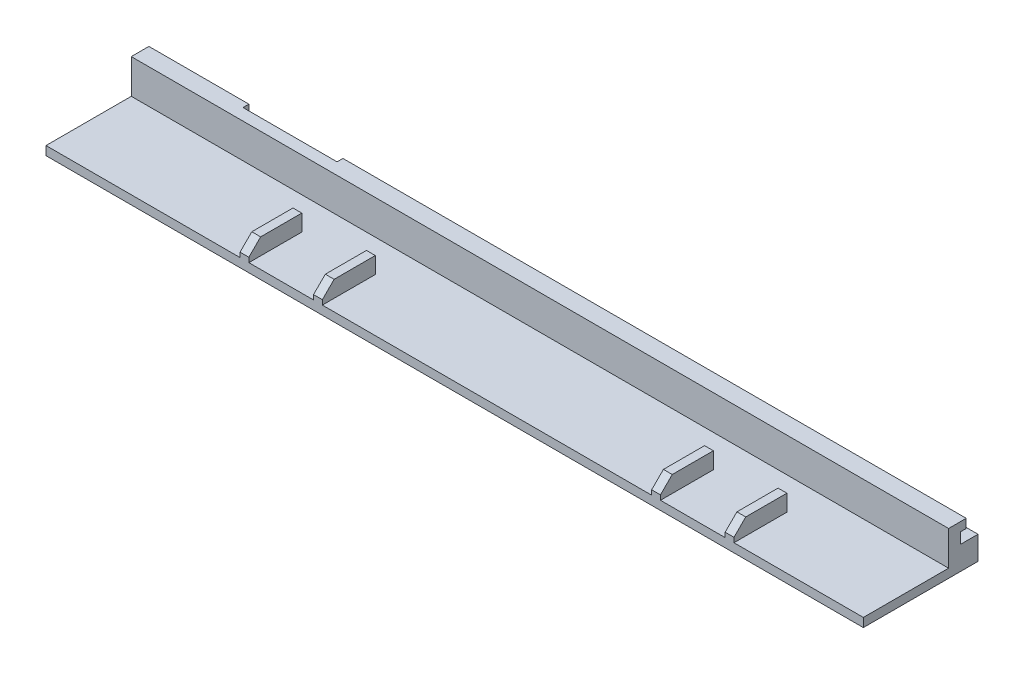
ISO-10303-21;
HEADER;
FILE_DESCRIPTION(('STEP AP214'),'2;1');
FILE_NAME('part.step','',(''),(''),'','','');
FILE_SCHEMA(('AUTOMOTIVE_DESIGN { 1 0 10303 214 1 1 1 1 }'));
ENDSEC;
DATA;
#1=APPLICATION_CONTEXT('core data for automotive mechanical design processes');
#2=APPLICATION_PROTOCOL_DEFINITION('international standard','automotive_design',2000,#1);
#3=PRODUCT_CONTEXT('',#1,'mechanical');
#4=PRODUCT('Part','Part','',(#3));
#5=PRODUCT_RELATED_PRODUCT_CATEGORY('part','',(#4));
#6=PRODUCT_DEFINITION_FORMATION('','',#4);
#7=PRODUCT_DEFINITION_CONTEXT('part definition',#1,'design');
#8=PRODUCT_DEFINITION('design','',#6,#7);
#9=PRODUCT_DEFINITION_SHAPE('','',#8);
#10=(LENGTH_UNIT() NAMED_UNIT(*) SI_UNIT(.MILLI.,.METRE.));
#11=(NAMED_UNIT(*) PLANE_ANGLE_UNIT() SI_UNIT($,.RADIAN.));
#12=(NAMED_UNIT(*) SI_UNIT($,.STERADIAN.) SOLID_ANGLE_UNIT());
#13=UNCERTAINTY_MEASURE_WITH_UNIT(LENGTH_MEASURE(1.E-05),#10,'distance_accuracy_value','');
#14=(GEOMETRIC_REPRESENTATION_CONTEXT(3) GLOBAL_UNCERTAINTY_ASSIGNED_CONTEXT((#13)) GLOBAL_UNIT_ASSIGNED_CONTEXT((#10,
#11,#12)) REPRESENTATION_CONTEXT('',''));
#15=CARTESIAN_POINT('',(0.,0.,0.));
#16=DIRECTION('',(0.,0.,1.));
#17=DIRECTION('',(1.,0.,0.));
#18=AXIS2_PLACEMENT_3D('',#15,#16,#17);
#19=CARTESIAN_POINT('',(150.,0.,-3.));
#20=DIRECTION('',(0.,0.,1.));
#21=DIRECTION('',(1.,0.,0.));
#22=AXIS2_PLACEMENT_3D('',#19,#20,#21);
#23=PLANE('',#22);
#24=DIRECTION('',(-1.,0.,0.));
#25=VECTOR('',#24,1.);
#26=CARTESIAN_POINT('',(150.,0.,-3.));
#27=LINE('',#26,#25);
#28=CARTESIAN_POINT('',(139.,0.,-3.));
#29=VERTEX_POINT('',#28);
#30=CARTESIAN_POINT('',(33.,0.,-3.));
#31=VERTEX_POINT('',#30);
#32=EDGE_CURVE('E597',#29,#31,#27,.T.);
#33=ORIENTED_EDGE('',*,*,#32,.T.);
#34=DIRECTION('',(0.,1.,0.));
#35=VECTOR('',#34,1.);
#36=CARTESIAN_POINT('',(33.,-14.65,-3.));
#37=LINE('',#36,#35);
#38=CARTESIAN_POINT('',(33.,4.,-3.));
#39=VERTEX_POINT('',#38);
#40=EDGE_CURVE('E318',#31,#39,#37,.T.);
#41=ORIENTED_EDGE('',*,*,#40,.T.);
#42=DIRECTION('',(-1.,0.,0.));
#43=VECTOR('',#42,1.);
#44=CARTESIAN_POINT('',(150.,4.,-3.));
#45=LINE('',#44,#43);
#46=CARTESIAN_POINT('',(139.,4.,-3.));
#47=VERTEX_POINT('',#46);
#48=EDGE_CURVE('E593',#47,#39,#45,.T.);
#49=ORIENTED_EDGE('',*,*,#48,.F.);
#50=DIRECTION('',(0.,1.,0.));
#51=VECTOR('',#50,1.);
#52=CARTESIAN_POINT('',(139.,-14.65,-3.));
#53=LINE('',#52,#51);
#54=EDGE_CURVE('E334',#29,#47,#53,.T.);
#55=ORIENTED_EDGE('',*,*,#54,.F.);
#56=EDGE_LOOP('',(#33,#41,#49,#55));
#57=FACE_BOUND('',#56,.T.);
#58=ADVANCED_FACE('F43',(#57),#23,.F.);
#59=CARTESIAN_POINT('',(150.,4.,-3.));
#60=DIRECTION('',(0.,-1.,0.));
#61=DIRECTION('',(0.,0.,-1.));
#62=AXIS2_PLACEMENT_3D('',#59,#60,#61);
#63=PLANE('',#62);
#64=ORIENTED_EDGE('',*,*,#48,.T.);
#65=DIRECTION('',(0.,0.,1.));
#66=VECTOR('',#65,1.);
#67=CARTESIAN_POINT('',(33.,4.,-3.));
#68=LINE('',#67,#66);
#69=CARTESIAN_POINT('',(33.,4.,0.));
#70=VERTEX_POINT('',#69);
#71=EDGE_CURVE('E382',#39,#70,#68,.T.);
#72=ORIENTED_EDGE('',*,*,#71,.T.);
#73=DIRECTION('',(-1.,0.,0.));
#74=VECTOR('',#73,1.);
#75=CARTESIAN_POINT('',(150.,4.,0.));
#76=LINE('',#75,#74);
#77=CARTESIAN_POINT('',(139.,4.,0.));
#78=VERTEX_POINT('',#77);
#79=EDGE_CURVE('E589',#78,#70,#76,.T.);
#80=ORIENTED_EDGE('',*,*,#79,.F.);
#81=DIRECTION('',(0.,0.,-1.));
#82=VECTOR('',#81,1.);
#83=CARTESIAN_POINT('',(139.,4.,-3.));
#84=LINE('',#83,#82);
#85=EDGE_CURVE('E361',#78,#47,#84,.T.);
#86=ORIENTED_EDGE('',*,*,#85,.T.);
#87=EDGE_LOOP('',(#64,#72,#80,#86));
#88=FACE_BOUND('',#87,.T.);
#89=ADVANCED_FACE('F752',(#88),#63,.F.);
#90=CARTESIAN_POINT('',(150.,5.85,0.));
#91=DIRECTION('',(0.,1.,0.));
#92=DIRECTION('',(0.,0.,1.));
#93=AXIS2_PLACEMENT_3D('',#90,#91,#92);
#94=PLANE('',#93);
#95=DIRECTION('',(-1.,0.,0.));
#96=VECTOR('',#95,1.);
#97=CARTESIAN_POINT('',(150.,5.85,0.));
#98=LINE('',#97,#96);
#99=CARTESIAN_POINT('',(139.,5.85,0.));
#100=VERTEX_POINT('',#99);
#101=CARTESIAN_POINT('',(33.,5.85,0.));
#102=VERTEX_POINT('',#101);
#103=EDGE_CURVE('E585',#100,#102,#98,.T.);
#104=ORIENTED_EDGE('',*,*,#103,.T.);
#105=DIRECTION('',(0.,0.,-1.));
#106=VECTOR('',#105,1.);
#107=CARTESIAN_POINT('',(33.,5.85,0.));
#108=LINE('',#107,#106);
#109=CARTESIAN_POINT('',(33.,5.85,-1.));
#110=VERTEX_POINT('',#109);
#111=EDGE_CURVE('E378',#102,#110,#108,.T.);
#112=ORIENTED_EDGE('',*,*,#111,.T.);
#113=DIRECTION('',(-1.,0.,0.));
#114=VECTOR('',#113,1.);
#115=CARTESIAN_POINT('',(150.,5.85,-1.));
#116=LINE('',#115,#114);
#117=CARTESIAN_POINT('',(139.,5.85,-1.));
#118=VERTEX_POINT('',#117);
#119=EDGE_CURVE('E582',#118,#110,#116,.T.);
#120=ORIENTED_EDGE('',*,*,#119,.F.);
#121=DIRECTION('',(0.,0.,1.));
#122=VECTOR('',#121,1.);
#123=CARTESIAN_POINT('',(139.,5.85,0.));
#124=LINE('',#123,#122);
#125=EDGE_CURVE('E353',#118,#100,#124,.T.);
#126=ORIENTED_EDGE('',*,*,#125,.T.);
#127=EDGE_LOOP('',(#104,#112,#120,#126));
#128=FACE_BOUND('',#127,.T.);
#129=ADVANCED_FACE('F759',(#128),#94,.F.);
#130=CARTESIAN_POINT('',(150.,5.85,-1.));
#131=DIRECTION('',(0.,0.,1.));
#132=DIRECTION('',(1.,0.,0.));
#133=AXIS2_PLACEMENT_3D('',#130,#131,#132);
#134=PLANE('',#133);
#135=ORIENTED_EDGE('',*,*,#119,.T.);
#136=DIRECTION('',(0.,1.,0.));
#137=VECTOR('',#136,1.);
#138=CARTESIAN_POINT('',(33.,5.85,-1.));
#139=LINE('',#138,#137);
#140=CARTESIAN_POINT('',(33.,7.35,-1.));
#141=VERTEX_POINT('',#140);
#142=EDGE_CURVE('E374',#110,#141,#139,.T.);
#143=ORIENTED_EDGE('',*,*,#142,.T.);
#144=DIRECTION('',(-1.,0.,0.));
#145=VECTOR('',#144,1.);
#146=CARTESIAN_POINT('',(150.,7.35,-1.));
#147=LINE('',#146,#145);
#148=CARTESIAN_POINT('',(139.,7.35,-1.));
#149=VERTEX_POINT('',#148);
#150=EDGE_CURVE('E578',#149,#141,#147,.T.);
#151=ORIENTED_EDGE('',*,*,#150,.F.);
#152=DIRECTION('',(0.,-1.,0.));
#153=VECTOR('',#152,1.);
#154=CARTESIAN_POINT('',(139.,5.85,-1.));
#155=LINE('',#154,#153);
#156=EDGE_CURVE('E349',#149,#118,#155,.T.);
#157=ORIENTED_EDGE('',*,*,#156,.T.);
#158=EDGE_LOOP('',(#135,#143,#151,#157));
#159=FACE_BOUND('',#158,.T.);
#160=ADVANCED_FACE('F772',(#159),#134,.F.);
#161=CARTESIAN_POINT('',(150.,1.5,16.5));
#162=DIRECTION('',(0.,-1.,0.));
#163=DIRECTION('',(0.,0.,-1.));
#164=AXIS2_PLACEMENT_3D('',#161,#162,#163);
#165=PLANE('',#164);
#166=DIRECTION('',(-1.,0.,0.));
#167=VECTOR('',#166,1.);
#168=CARTESIAN_POINT('',(150.,1.5,16.5));
#169=LINE('',#168,#167);
#170=CARTESIAN_POINT('',(139.,1.5,16.5));
#171=VERTEX_POINT('',#170);
#172=CARTESIAN_POINT('',(117.,1.5,16.5));
#173=VERTEX_POINT('',#172);
#174=EDGE_CURVE('E564',#171,#173,#169,.T.);
#175=ORIENTED_EDGE('',*,*,#174,.F.);
#176=DIRECTION('',(0.,0.,-1.));
#177=VECTOR('',#176,1.);
#178=CARTESIAN_POINT('',(139.,1.5,16.5));
#179=LINE('',#178,#177);
#180=CARTESIAN_POINT('',(139.,1.5,2.));
#181=VERTEX_POINT('',#180);
#182=EDGE_CURVE('E345',#171,#181,#179,.T.);
#183=ORIENTED_EDGE('',*,*,#182,.T.);
#184=DIRECTION('',(-1.,0.,0.));
#185=VECTOR('',#184,1.);
#186=CARTESIAN_POINT('',(150.,1.5,2.));
#187=LINE('',#186,#185);
#188=CARTESIAN_POINT('',(0.,1.5,2.));
#189=VERTEX_POINT('',#188);
#190=EDGE_CURVE('E568',#181,#189,#187,.T.);
#191=ORIENTED_EDGE('',*,*,#190,.T.);
#192=DIRECTION('',(0.,0.,1.));
#193=VECTOR('',#192,1.);
#194=CARTESIAN_POINT('',(0.,1.5,16.5));
#195=LINE('',#194,#193);
#196=CARTESIAN_POINT('',(0.,1.5,16.5));
#197=VERTEX_POINT('',#196);
#198=EDGE_CURVE('E548',#189,#197,#195,.T.);
#199=ORIENTED_EDGE('',*,*,#198,.T.);
#200=CARTESIAN_POINT('',(33.,1.5,16.5));
#201=VERTEX_POINT('',#200);
#202=EDGE_CURVE('E563',#201,#197,#169,.T.);
#203=ORIENTED_EDGE('',*,*,#202,.F.);
#204=DIRECTION('',(0.,0.,1.));
#205=VECTOR('',#204,1.);
#206=CARTESIAN_POINT('',(33.,1.5,16.5));
#207=LINE('',#206,#205);
#208=CARTESIAN_POINT('',(33.,1.5,7.49999999999999));
#209=VERTEX_POINT('',#208);
#210=EDGE_CURVE('E488',#209,#201,#207,.T.);
#211=ORIENTED_EDGE('',*,*,#210,.F.);
#212=DIRECTION('',(-1.,0.,0.));
#213=VECTOR('',#212,1.);
#214=CARTESIAN_POINT('',(33.,1.5,7.49999999999999));
#215=LINE('',#214,#213);
#216=CARTESIAN_POINT('',(34.5,1.5,7.49999999999999));
#217=VERTEX_POINT('',#216);
#218=EDGE_CURVE('E493',#217,#209,#215,.T.);
#219=ORIENTED_EDGE('',*,*,#218,.F.);
#220=DIRECTION('',(0.,0.,-1.));
#221=VECTOR('',#220,1.);
#222=CARTESIAN_POINT('',(34.5,1.5,16.5));
#223=LINE('',#222,#221);
#224=CARTESIAN_POINT('',(34.5,1.5,16.5));
#225=VERTEX_POINT('',#224);
#226=EDGE_CURVE('E503',#225,#217,#223,.T.);
#227=ORIENTED_EDGE('',*,*,#226,.F.);
#228=CARTESIAN_POINT('',(45.5,1.5,16.5));
#229=VERTEX_POINT('',#228);
#230=EDGE_CURVE('E669',#229,#225,#169,.T.);
#231=ORIENTED_EDGE('',*,*,#230,.F.);
#232=DIRECTION('',(0.,0.,1.));
#233=VECTOR('',#232,1.);
#234=CARTESIAN_POINT('',(45.5,1.5,16.5));
#235=LINE('',#234,#233);
#236=CARTESIAN_POINT('',(45.5,1.5,7.49999999999999));
#237=VERTEX_POINT('',#236);
#238=EDGE_CURVE('E454',#237,#229,#235,.T.);
#239=ORIENTED_EDGE('',*,*,#238,.F.);
#240=DIRECTION('',(-1.,0.,0.));
#241=VECTOR('',#240,1.);
#242=CARTESIAN_POINT('',(45.5,1.5,7.49999999999999));
#243=LINE('',#242,#241);
#244=CARTESIAN_POINT('',(47.,1.5,7.49999999999999));
#245=VERTEX_POINT('',#244);
#246=EDGE_CURVE('E460',#245,#237,#243,.T.);
#247=ORIENTED_EDGE('',*,*,#246,.F.);
#248=DIRECTION('',(0.,0.,-1.));
#249=VECTOR('',#248,1.);
#250=CARTESIAN_POINT('',(47.,1.5,16.5));
#251=LINE('',#250,#249);
#252=CARTESIAN_POINT('',(47.,1.5,16.5));
#253=VERTEX_POINT('',#252);
#254=EDGE_CURVE('E470',#253,#245,#251,.T.);
#255=ORIENTED_EDGE('',*,*,#254,.F.);
#256=CARTESIAN_POINT('',(103.,1.5,16.5));
#257=VERTEX_POINT('',#256);
#258=EDGE_CURVE('E687',#257,#253,#169,.T.);
#259=ORIENTED_EDGE('',*,*,#258,.F.);
#260=DIRECTION('',(0.,0.,1.));
#261=VECTOR('',#260,1.);
#262=CARTESIAN_POINT('',(103.,1.5,16.5));
#263=LINE('',#262,#261);
#264=CARTESIAN_POINT('',(103.,1.5,7.49999999999999));
#265=VERTEX_POINT('',#264);
#266=EDGE_CURVE('E420',#265,#257,#263,.T.);
#267=ORIENTED_EDGE('',*,*,#266,.F.);
#268=DIRECTION('',(-1.,0.,0.));
#269=VECTOR('',#268,1.);
#270=CARTESIAN_POINT('',(103.,1.5,7.49999999999999));
#271=LINE('',#270,#269);
#272=CARTESIAN_POINT('',(104.5,1.5,7.49999999999999));
#273=VERTEX_POINT('',#272);
#274=EDGE_CURVE('E426',#273,#265,#271,.T.);
#275=ORIENTED_EDGE('',*,*,#274,.F.);
#276=DIRECTION('',(0.,0.,-1.));
#277=VECTOR('',#276,1.);
#278=CARTESIAN_POINT('',(104.5,1.5,16.5));
#279=LINE('',#278,#277);
#280=CARTESIAN_POINT('',(104.5,1.5,16.5));
#281=VERTEX_POINT('',#280);
#282=EDGE_CURVE('E436',#281,#273,#279,.T.);
#283=ORIENTED_EDGE('',*,*,#282,.F.);
#284=CARTESIAN_POINT('',(115.5,1.5,16.5));
#285=VERTEX_POINT('',#284);
#286=EDGE_CURVE('E569',#285,#281,#169,.T.);
#287=ORIENTED_EDGE('',*,*,#286,.F.);
#288=DIRECTION('',(0.,0.,1.));
#289=VECTOR('',#288,1.);
#290=CARTESIAN_POINT('',(115.5,1.5,16.5));
#291=LINE('',#290,#289);
#292=CARTESIAN_POINT('',(115.5,1.5,7.49999999999999));
#293=VERTEX_POINT('',#292);
#294=EDGE_CURVE('E386',#293,#285,#291,.T.);
#295=ORIENTED_EDGE('',*,*,#294,.F.);
#296=DIRECTION('',(-1.,0.,0.));
#297=VECTOR('',#296,1.);
#298=CARTESIAN_POINT('',(115.5,1.5,7.49999999999999));
#299=LINE('',#298,#297);
#300=CARTESIAN_POINT('',(117.,1.5,7.49999999999999));
#301=VERTEX_POINT('',#300);
#302=EDGE_CURVE('E392',#301,#293,#299,.T.);
#303=ORIENTED_EDGE('',*,*,#302,.F.);
#304=DIRECTION('',(0.,0.,-1.));
#305=VECTOR('',#304,1.);
#306=CARTESIAN_POINT('',(117.,1.5,16.5));
#307=LINE('',#306,#305);
#308=EDGE_CURVE('E402',#173,#301,#307,.T.);
#309=ORIENTED_EDGE('',*,*,#308,.F.);
#310=EDGE_LOOP('',(#175,#183,#191,#199,#203,#211,#219,#227,#231,#239,#247,#255,#259,#267,#275,
#283,#287,#295,#303,#309));
#311=FACE_BOUND('',#310,.T.);
#312=ADVANCED_FACE('F682',(#311),#165,.F.);
#313=CARTESIAN_POINT('',(17.,4.,-3.));
#314=VERTEX_POINT('',#313);
#315=CARTESIAN_POINT('',(0.,4.,-3.));
#316=VERTEX_POINT('',#315);
#317=EDGE_CURVE('E590',#314,#316,#45,.T.);
#318=ORIENTED_EDGE('',*,*,#317,.F.);
#319=DIRECTION('',(0.,1.,0.));
#320=VECTOR('',#319,1.);
#321=CARTESIAN_POINT('',(17.,-14.65,-3.));
#322=LINE('',#321,#320);
#323=CARTESIAN_POINT('',(17.,0.,-3.));
#324=VERTEX_POINT('',#323);
#325=EDGE_CURVE('E303',#324,#314,#322,.T.);
#326=ORIENTED_EDGE('',*,*,#325,.F.);
#327=CARTESIAN_POINT('',(0.,0.,-3.));
#328=VERTEX_POINT('',#327);
#329=EDGE_CURVE('E594',#324,#328,#27,.T.);
#330=ORIENTED_EDGE('',*,*,#329,.T.);
#331=DIRECTION('',(0.,1.,0.));
#332=VECTOR('',#331,1.);
#333=CARTESIAN_POINT('',(0.,0.,-3.));
#334=LINE('',#333,#332);
#335=EDGE_CURVE('E521',#328,#316,#334,.T.);
#336=ORIENTED_EDGE('',*,*,#335,.T.);
#337=EDGE_LOOP('',(#318,#326,#330,#336));
#338=FACE_BOUND('',#337,.T.);
#339=ADVANCED_FACE('F755',(#338),#23,.F.);
#340=CARTESIAN_POINT('',(17.,4.,0.));
#341=VERTEX_POINT('',#340);
#342=CARTESIAN_POINT('',(0.,4.,0.));
#343=VERTEX_POINT('',#342);
#344=EDGE_CURVE('E586',#341,#343,#76,.T.);
#345=ORIENTED_EDGE('',*,*,#344,.F.);
#346=DIRECTION('',(0.,0.,-1.));
#347=VECTOR('',#346,1.);
#348=CARTESIAN_POINT('',(17.,4.,-2.99999999999938));
#349=LINE('',#348,#347);
#350=EDGE_CURVE('E370',#341,#314,#349,.T.);
#351=ORIENTED_EDGE('',*,*,#350,.T.);
#352=ORIENTED_EDGE('',*,*,#317,.T.);
#353=DIRECTION('',(0.,0.,1.));
#354=VECTOR('',#353,1.);
#355=CARTESIAN_POINT('',(0.,4.,-3.));
#356=LINE('',#355,#354);
#357=EDGE_CURVE('E525',#316,#343,#356,.T.);
#358=ORIENTED_EDGE('',*,*,#357,.T.);
#359=EDGE_LOOP('',(#345,#351,#352,#358));
#360=FACE_BOUND('',#359,.T.);
#361=ADVANCED_FACE('F762',(#360),#63,.F.);
#362=CARTESIAN_POINT('',(150.,4.,0.));
#363=DIRECTION('',(0.,0.,1.));
#364=DIRECTION('',(1.,0.,0.));
#365=AXIS2_PLACEMENT_3D('',#362,#363,#364);
#366=PLANE('',#365);
#367=CARTESIAN_POINT('',(17.,5.85,0.));
#368=VERTEX_POINT('',#367);
#369=CARTESIAN_POINT('',(0.,5.85,0.));
#370=VERTEX_POINT('',#369);
#371=EDGE_CURVE('E298',#368,#370,#98,.T.);
#372=ORIENTED_EDGE('',*,*,#371,.F.);
#373=DIRECTION('',(0.,1.,0.));
#374=VECTOR('',#373,1.);
#375=CARTESIAN_POINT('',(17.,-14.65,0.));
#376=LINE('',#375,#374);
#377=CARTESIAN_POINT('',(17.,7.35,0.));
#378=VERTEX_POINT('',#377);
#379=EDGE_CURVE('E290',#368,#378,#376,.T.);
#380=ORIENTED_EDGE('',*,*,#379,.T.);
#381=DIRECTION('',(1.,0.,0.));
#382=VECTOR('',#381,1.);
#383=CARTESIAN_POINT('',(33.,7.35,0.));
#384=LINE('',#383,#382);
#385=CARTESIAN_POINT('',(33.,7.35,0.));
#386=VERTEX_POINT('',#385);
#387=EDGE_CURVE('E295',#378,#386,#384,.T.);
#388=ORIENTED_EDGE('',*,*,#387,.T.);
#389=DIRECTION('',(0.,1.,0.));
#390=VECTOR('',#389,1.);
#391=CARTESIAN_POINT('',(33.,-14.65,0.));
#392=LINE('',#391,#390);
#393=EDGE_CURVE('E325',#102,#386,#392,.T.);
#394=ORIENTED_EDGE('',*,*,#393,.F.);
#395=ORIENTED_EDGE('',*,*,#103,.F.);
#396=DIRECTION('',(0.,-1.,0.));
#397=VECTOR('',#396,1.);
#398=CARTESIAN_POINT('',(139.,4.,0.));
#399=LINE('',#398,#397);
#400=EDGE_CURVE('E357',#100,#78,#399,.T.);
#401=ORIENTED_EDGE('',*,*,#400,.T.);
#402=ORIENTED_EDGE('',*,*,#79,.T.);
#403=CARTESIAN_POINT('',(33.,0.,0.));
#404=VERTEX_POINT('',#403);
#405=EDGE_CURVE('E327',#404,#70,#392,.T.);
#406=ORIENTED_EDGE('',*,*,#405,.F.);
#407=DIRECTION('',(1.,0.,0.));
#408=VECTOR('',#407,1.);
#409=CARTESIAN_POINT('',(150.,0.,0.));
#410=LINE('',#409,#408);
#411=CARTESIAN_POINT('',(17.,0.,0.));
#412=VERTEX_POINT('',#411);
#413=EDGE_CURVE('E606',#412,#404,#410,.T.);
#414=ORIENTED_EDGE('',*,*,#413,.F.);
#415=EDGE_CURVE('E302',#412,#341,#376,.T.);
#416=ORIENTED_EDGE('',*,*,#415,.T.);
#417=ORIENTED_EDGE('',*,*,#344,.T.);
#418=DIRECTION('',(0.,1.,0.));
#419=VECTOR('',#418,1.);
#420=CARTESIAN_POINT('',(0.,4.,0.));
#421=LINE('',#420,#419);
#422=EDGE_CURVE('E529',#343,#370,#421,.T.);
#423=ORIENTED_EDGE('',*,*,#422,.T.);
#424=EDGE_LOOP('',(#372,#380,#388,#394,#395,#401,#402,#406,#414,#416,#417,#423));
#425=FACE_BOUND('',#424,.T.);
#426=ADVANCED_FACE('F292',(#425),#366,.F.);
#427=CARTESIAN_POINT('',(17.,5.85,-1.));
#428=VERTEX_POINT('',#427);
#429=CARTESIAN_POINT('',(0.,5.85,-1.));
#430=VERTEX_POINT('',#429);
#431=EDGE_CURVE('E579',#428,#430,#116,.T.);
#432=ORIENTED_EDGE('',*,*,#431,.F.);
#433=DIRECTION('',(0.,0.,1.));
#434=VECTOR('',#433,1.);
#435=CARTESIAN_POINT('',(17.,5.85,6.15248592813106E-13));
#436=LINE('',#435,#434);
#437=EDGE_CURVE('E367',#428,#368,#436,.T.);
#438=ORIENTED_EDGE('',*,*,#437,.T.);
#439=ORIENTED_EDGE('',*,*,#371,.T.);
#440=DIRECTION('',(0.,0.,-1.));
#441=VECTOR('',#440,1.);
#442=CARTESIAN_POINT('',(0.,5.85,0.));
#443=LINE('',#442,#441);
#444=EDGE_CURVE('E532',#370,#430,#443,.T.);
#445=ORIENTED_EDGE('',*,*,#444,.T.);
#446=EDGE_LOOP('',(#432,#438,#439,#445));
#447=FACE_BOUND('',#446,.T.);
#448=ADVANCED_FACE('F826',(#447),#94,.F.);
#449=CARTESIAN_POINT('',(17.,7.35,-1.));
#450=VERTEX_POINT('',#449);
#451=CARTESIAN_POINT('',(0.,7.35,-1.));
#452=VERTEX_POINT('',#451);
#453=EDGE_CURVE('E575',#450,#452,#147,.T.);
#454=ORIENTED_EDGE('',*,*,#453,.F.);
#455=DIRECTION('',(0.,-1.,0.));
#456=VECTOR('',#455,1.);
#457=CARTESIAN_POINT('',(17.,5.85,-1.));
#458=LINE('',#457,#456);
#459=EDGE_CURVE('E309',#450,#428,#458,.T.);
#460=ORIENTED_EDGE('',*,*,#459,.T.);
#461=ORIENTED_EDGE('',*,*,#431,.T.);
#462=DIRECTION('',(0.,1.,0.));
#463=VECTOR('',#462,1.);
#464=CARTESIAN_POINT('',(0.,5.85,-1.));
#465=LINE('',#464,#463);
#466=EDGE_CURVE('E536',#430,#452,#465,.T.);
#467=ORIENTED_EDGE('',*,*,#466,.T.);
#468=EDGE_LOOP('',(#454,#460,#461,#467));
#469=FACE_BOUND('',#468,.T.);
#470=ADVANCED_FACE('F828',(#469),#134,.F.);
#471=CARTESIAN_POINT('',(150.,7.35,-1.));
#472=DIRECTION('',(0.,-1.,0.));
#473=DIRECTION('',(0.,0.,-1.));
#474=AXIS2_PLACEMENT_3D('',#471,#472,#473);
#475=PLANE('',#474);
#476=ORIENTED_EDGE('',*,*,#150,.T.);
#477=DIRECTION('',(0.,0.,-1.));
#478=VECTOR('',#477,1.);
#479=CARTESIAN_POINT('',(33.,7.35,0.));
#480=LINE('',#479,#478);
#481=EDGE_CURVE('E313',#386,#141,#480,.T.);
#482=ORIENTED_EDGE('',*,*,#481,.F.);
#483=ORIENTED_EDGE('',*,*,#387,.F.);
#484=DIRECTION('',(0.,0.,1.));
#485=VECTOR('',#484,1.);
#486=CARTESIAN_POINT('',(17.,7.35,0.));
#487=LINE('',#486,#485);
#488=EDGE_CURVE('E306',#450,#378,#487,.T.);
#489=ORIENTED_EDGE('',*,*,#488,.F.);
#490=ORIENTED_EDGE('',*,*,#453,.T.);
#491=DIRECTION('',(0.,0.,1.));
#492=VECTOR('',#491,1.);
#493=CARTESIAN_POINT('',(0.,7.35,-1.));
#494=LINE('',#493,#492);
#495=CARTESIAN_POINT('',(0.,7.35,2.));
#496=VERTEX_POINT('',#495);
#497=EDGE_CURVE('E540',#452,#496,#494,.T.);
#498=ORIENTED_EDGE('',*,*,#497,.T.);
#499=DIRECTION('',(-1.,0.,0.));
#500=VECTOR('',#499,1.);
#501=CARTESIAN_POINT('',(150.,7.35,2.));
#502=LINE('',#501,#500);
#503=CARTESIAN_POINT('',(139.,7.35,2.));
#504=VERTEX_POINT('',#503);
#505=EDGE_CURVE('E572',#504,#496,#502,.T.);
#506=ORIENTED_EDGE('',*,*,#505,.F.);
#507=DIRECTION('',(0.,0.,1.));
#508=VECTOR('',#507,1.);
#509=CARTESIAN_POINT('',(139.,7.35,-3.));
#510=LINE('',#509,#508);
#511=EDGE_CURVE('E331',#149,#504,#510,.T.);
#512=ORIENTED_EDGE('',*,*,#511,.F.);
#513=EDGE_LOOP('',(#476,#482,#483,#489,#490,#498,#506,#512));
#514=FACE_BOUND('',#513,.T.);
#515=ADVANCED_FACE('F316',(#514),#475,.F.);
#516=CARTESIAN_POINT('',(150.,4.,2.));
#517=DIRECTION('',(0.,0.,-1.));
#518=DIRECTION('',(-1.,0.,0.));
#519=AXIS2_PLACEMENT_3D('',#516,#517,#518);
#520=PLANE('',#519);
#521=ORIENTED_EDGE('',*,*,#190,.F.);
#522=DIRECTION('',(0.,1.,0.));
#523=VECTOR('',#522,1.);
#524=CARTESIAN_POINT('',(139.,4.,2.));
#525=LINE('',#524,#523);
#526=EDGE_CURVE('E341',#181,#504,#525,.T.);
#527=ORIENTED_EDGE('',*,*,#526,.T.);
#528=ORIENTED_EDGE('',*,*,#505,.T.);
#529=DIRECTION('',(0.,-1.,0.));
#530=VECTOR('',#529,1.);
#531=CARTESIAN_POINT('',(0.,4.,2.));
#532=LINE('',#531,#530);
#533=EDGE_CURVE('E544',#496,#189,#532,.T.);
#534=ORIENTED_EDGE('',*,*,#533,.T.);
#535=EDGE_LOOP('',(#521,#527,#528,#534));
#536=FACE_BOUND('',#535,.T.);
#537=ADVANCED_FACE('F832',(#536),#520,.F.);
#538=CARTESIAN_POINT('',(150.,0.,16.5));
#539=DIRECTION('',(0.,0.,-1.));
#540=DIRECTION('',(-1.,0.,0.));
#541=AXIS2_PLACEMENT_3D('',#538,#539,#540);
#542=PLANE('',#541);
#543=DIRECTION('',(0.,-1.,0.));
#544=VECTOR('',#543,1.);
#545=CARTESIAN_POINT('',(117.,4.3,16.5));
#546=LINE('',#545,#544);
#547=CARTESIAN_POINT('',(117.,2.29999999999996,16.5));
#548=VERTEX_POINT('',#547);
#549=EDGE_CURVE('E414',#548,#173,#546,.T.);
#550=ORIENTED_EDGE('',*,*,#549,.F.);
#551=DIRECTION('',(-1.,0.,0.));
#552=VECTOR('',#551,1.);
#553=CARTESIAN_POINT('',(150.,2.29999999999996,16.5));
#554=LINE('',#553,#552);
#555=CARTESIAN_POINT('',(115.5,2.29999999999996,16.5));
#556=VERTEX_POINT('',#555);
#557=EDGE_CURVE('E630',#548,#556,#554,.T.);
#558=ORIENTED_EDGE('',*,*,#557,.T.);
#559=DIRECTION('',(0.,-1.,0.));
#560=VECTOR('',#559,1.);
#561=CARTESIAN_POINT('',(115.5,4.3,16.5));
#562=LINE('',#561,#560);
#563=EDGE_CURVE('E417',#556,#285,#562,.T.);
#564=ORIENTED_EDGE('',*,*,#563,.T.);
#565=ORIENTED_EDGE('',*,*,#286,.T.);
#566=DIRECTION('',(0.,-1.,0.));
#567=VECTOR('',#566,1.);
#568=CARTESIAN_POINT('',(104.5,4.3,16.5));
#569=LINE('',#568,#567);
#570=CARTESIAN_POINT('',(104.5,2.29999999999996,16.5));
#571=VERTEX_POINT('',#570);
#572=EDGE_CURVE('E448',#571,#281,#569,.T.);
#573=ORIENTED_EDGE('',*,*,#572,.F.);
#574=DIRECTION('',(-1.,0.,0.));
#575=VECTOR('',#574,1.);
#576=CARTESIAN_POINT('',(150.,2.29999999999996,16.5));
#577=LINE('',#576,#575);
#578=CARTESIAN_POINT('',(103.,2.29999999999996,16.5));
#579=VERTEX_POINT('',#578);
#580=EDGE_CURVE('E627',#571,#579,#577,.T.);
#581=ORIENTED_EDGE('',*,*,#580,.T.);
#582=DIRECTION('',(0.,-1.,0.));
#583=VECTOR('',#582,1.);
#584=CARTESIAN_POINT('',(103.,4.3,16.5));
#585=LINE('',#584,#583);
#586=EDGE_CURVE('E451',#579,#257,#585,.T.);
#587=ORIENTED_EDGE('',*,*,#586,.T.);
#588=ORIENTED_EDGE('',*,*,#258,.T.);
#589=DIRECTION('',(0.,-1.,0.));
#590=VECTOR('',#589,1.);
#591=CARTESIAN_POINT('',(47.,4.3,16.5));
#592=LINE('',#591,#590);
#593=CARTESIAN_POINT('',(47.,2.3,16.5));
#594=VERTEX_POINT('',#593);
#595=EDGE_CURVE('E482',#594,#253,#592,.T.);
#596=ORIENTED_EDGE('',*,*,#595,.F.);
#597=DIRECTION('',(-1.,0.,0.));
#598=VECTOR('',#597,1.);
#599=CARTESIAN_POINT('',(150.,2.3,16.5));
#600=LINE('',#599,#598);
#601=CARTESIAN_POINT('',(45.5,2.3,16.5));
#602=VERTEX_POINT('',#601);
#603=EDGE_CURVE('E624',#594,#602,#600,.T.);
#604=ORIENTED_EDGE('',*,*,#603,.T.);
#605=DIRECTION('',(0.,-1.,0.));
#606=VECTOR('',#605,1.);
#607=CARTESIAN_POINT('',(45.5,4.3,16.5));
#608=LINE('',#607,#606);
#609=EDGE_CURVE('E485',#602,#229,#608,.T.);
#610=ORIENTED_EDGE('',*,*,#609,.T.);
#611=ORIENTED_EDGE('',*,*,#230,.T.);
#612=DIRECTION('',(0.,-1.,0.));
#613=VECTOR('',#612,1.);
#614=CARTESIAN_POINT('',(34.5,4.3,16.5));
#615=LINE('',#614,#613);
#616=CARTESIAN_POINT('',(34.5,2.3,16.5));
#617=VERTEX_POINT('',#616);
#618=EDGE_CURVE('E515',#617,#225,#615,.T.);
#619=ORIENTED_EDGE('',*,*,#618,.F.);
#620=DIRECTION('',(-1.,0.,0.));
#621=VECTOR('',#620,1.);
#622=CARTESIAN_POINT('',(150.,2.3,16.5));
#623=LINE('',#622,#621);
#624=CARTESIAN_POINT('',(33.,2.3,16.5));
#625=VERTEX_POINT('',#624);
#626=EDGE_CURVE('E621',#617,#625,#623,.T.);
#627=ORIENTED_EDGE('',*,*,#626,.T.);
#628=DIRECTION('',(0.,-1.,0.));
#629=VECTOR('',#628,1.);
#630=CARTESIAN_POINT('',(33.,4.3,16.5));
#631=LINE('',#630,#629);
#632=EDGE_CURVE('E518',#625,#201,#631,.T.);
#633=ORIENTED_EDGE('',*,*,#632,.T.);
#634=ORIENTED_EDGE('',*,*,#202,.T.);
#635=DIRECTION('',(0.,-1.,0.));
#636=VECTOR('',#635,1.);
#637=CARTESIAN_POINT('',(0.,0.,16.5));
#638=LINE('',#637,#636);
#639=CARTESIAN_POINT('',(0.,0.,16.5));
#640=VERTEX_POINT('',#639);
#641=EDGE_CURVE('E552',#197,#640,#638,.T.);
#642=ORIENTED_EDGE('',*,*,#641,.T.);
#643=DIRECTION('',(-1.,0.,0.));
#644=VECTOR('',#643,1.);
#645=CARTESIAN_POINT('',(150.,0.,16.5));
#646=LINE('',#645,#644);
#647=CARTESIAN_POINT('',(139.,0.,16.5));
#648=VERTEX_POINT('',#647);
#649=EDGE_CURVE('E560',#648,#640,#646,.T.);
#650=ORIENTED_EDGE('',*,*,#649,.F.);
#651=DIRECTION('',(0.,1.,0.));
#652=VECTOR('',#651,1.);
#653=CARTESIAN_POINT('',(139.,-14.65,16.5));
#654=LINE('',#653,#652);
#655=EDGE_CURVE('E335',#648,#171,#654,.T.);
#656=ORIENTED_EDGE('',*,*,#655,.T.);
#657=ORIENTED_EDGE('',*,*,#174,.T.);
#658=EDGE_LOOP('',(#550,#558,#564,#565,#573,#581,#587,#588,#596,#604,#610,#611,#619,#627,#633,
#634,#642,#650,#656,#657));
#659=FACE_BOUND('',#658,.T.);
#660=ADVANCED_FACE('F667',(#659),#542,.F.);
#661=CARTESIAN_POINT('',(150.,0.,0.));
#662=DIRECTION('',(0.,1.,0.));
#663=DIRECTION('',(0.,0.,1.));
#664=AXIS2_PLACEMENT_3D('',#661,#662,#663);
#665=PLANE('',#664);
#666=ORIENTED_EDGE('',*,*,#413,.T.);
#667=DIRECTION('',(0.,0.,-1.));
#668=VECTOR('',#667,1.);
#669=CARTESIAN_POINT('',(33.,0.,0.));
#670=LINE('',#669,#668);
#671=EDGE_CURVE('E610',#404,#31,#670,.T.);
#672=ORIENTED_EDGE('',*,*,#671,.T.);
#673=ORIENTED_EDGE('',*,*,#32,.F.);
#674=DIRECTION('',(0.,0.,1.));
#675=VECTOR('',#674,1.);
#676=CARTESIAN_POINT('',(139.,0.,0.));
#677=LINE('',#676,#675);
#678=EDGE_CURVE('E598',#29,#648,#677,.T.);
#679=ORIENTED_EDGE('',*,*,#678,.T.);
#680=ORIENTED_EDGE('',*,*,#649,.T.);
#681=DIRECTION('',(0.,0.,-1.));
#682=VECTOR('',#681,1.);
#683=CARTESIAN_POINT('',(0.,0.,0.));
#684=LINE('',#683,#682);
#685=EDGE_CURVE('E556',#640,#328,#684,.T.);
#686=ORIENTED_EDGE('',*,*,#685,.T.);
#687=ORIENTED_EDGE('',*,*,#329,.F.);
#688=DIRECTION('',(0.,0.,1.));
#689=VECTOR('',#688,1.);
#690=CARTESIAN_POINT('',(17.,0.,6.15248592813106E-13));
#691=LINE('',#690,#689);
#692=EDGE_CURVE('E602',#324,#412,#691,.T.);
#693=ORIENTED_EDGE('',*,*,#692,.T.);
#694=EDGE_LOOP('',(#666,#672,#673,#679,#680,#686,#687,#693));
#695=FACE_BOUND('',#694,.T.);
#696=ADVANCED_FACE('F816',(#695),#665,.F.);
#697=CARTESIAN_POINT('',(0.,0.,0.));
#698=DIRECTION('',(1.,0.,0.));
#699=DIRECTION('',(0.,0.,-1.));
#700=AXIS2_PLACEMENT_3D('',#697,#698,#699);
#701=PLANE('',#700);
#702=ORIENTED_EDGE('',*,*,#335,.F.);
#703=ORIENTED_EDGE('',*,*,#685,.F.);
#704=ORIENTED_EDGE('',*,*,#641,.F.);
#705=ORIENTED_EDGE('',*,*,#198,.F.);
#706=ORIENTED_EDGE('',*,*,#533,.F.);
#707=ORIENTED_EDGE('',*,*,#497,.F.);
#708=ORIENTED_EDGE('',*,*,#466,.F.);
#709=ORIENTED_EDGE('',*,*,#444,.F.);
#710=ORIENTED_EDGE('',*,*,#422,.F.);
#711=ORIENTED_EDGE('',*,*,#357,.F.);
#712=EDGE_LOOP('',(#702,#703,#704,#705,#706,#707,#708,#709,#710,#711));
#713=FACE_BOUND('',#712,.T.);
#714=ADVANCED_FACE('F820',(#713),#701,.F.);
#715=CARTESIAN_POINT('',(33.,4.3,16.5));
#716=DIRECTION('',(1.,0.,0.));
#717=DIRECTION('',(0.,0.,-1.));
#718=AXIS2_PLACEMENT_3D('',#715,#716,#717);
#719=PLANE('',#718);
#720=ORIENTED_EDGE('',*,*,#632,.F.);
#721=DIRECTION('',(0.,-0.70710678118655,0.707106781186545));
#722=VECTOR('',#721,1.);
#723=CARTESIAN_POINT('',(33.,4.3,14.5));
#724=LINE('',#723,#722);
#725=CARTESIAN_POINT('',(33.,4.3,14.5));
#726=VERTEX_POINT('',#725);
#727=EDGE_CURVE('E11',#625,#726,#724,.F.);
#728=ORIENTED_EDGE('',*,*,#727,.T.);
#729=DIRECTION('',(0.,0.,1.));
#730=VECTOR('',#729,1.);
#731=CARTESIAN_POINT('',(33.,4.3,16.5));
#732=LINE('',#731,#730);
#733=CARTESIAN_POINT('',(33.,4.3,7.49999999999999));
#734=VERTEX_POINT('',#733);
#735=EDGE_CURVE('E489',#734,#726,#732,.T.);
#736=ORIENTED_EDGE('',*,*,#735,.F.);
#737=DIRECTION('',(0.,-1.,0.));
#738=VECTOR('',#737,1.);
#739=CARTESIAN_POINT('',(33.,4.3,7.49999999999999));
#740=LINE('',#739,#738);
#741=EDGE_CURVE('E499',#734,#209,#740,.T.);
#742=ORIENTED_EDGE('',*,*,#741,.T.);
#743=ORIENTED_EDGE('',*,*,#210,.T.);
#744=EDGE_LOOP('',(#720,#728,#736,#742,#743));
#745=FACE_BOUND('',#744,.T.);
#746=ADVANCED_FACE('F675',(#745),#719,.F.);
#747=CARTESIAN_POINT('',(34.5,4.3,16.5));
#748=DIRECTION('',(-1.,0.,0.));
#749=DIRECTION('',(0.,0.,1.));
#750=AXIS2_PLACEMENT_3D('',#747,#748,#749);
#751=PLANE('',#750);
#752=DIRECTION('',(0.,0.,-1.));
#753=VECTOR('',#752,1.);
#754=CARTESIAN_POINT('',(34.5,4.3,16.5));
#755=LINE('',#754,#753);
#756=CARTESIAN_POINT('',(34.5,4.3,14.5));
#757=VERTEX_POINT('',#756);
#758=CARTESIAN_POINT('',(34.5,4.3,7.49999999999999));
#759=VERTEX_POINT('',#758);
#760=EDGE_CURVE('E492',#757,#759,#755,.T.);
#761=ORIENTED_EDGE('',*,*,#760,.F.);
#762=DIRECTION('',(0.,0.70710678118655,-0.707106781186545));
#763=VECTOR('',#762,1.);
#764=CARTESIAN_POINT('',(34.5,4.3,14.5));
#765=LINE('',#764,#763);
#766=EDGE_CURVE('E53',#757,#617,#765,.F.);
#767=ORIENTED_EDGE('',*,*,#766,.T.);
#768=ORIENTED_EDGE('',*,*,#618,.T.);
#769=ORIENTED_EDGE('',*,*,#226,.T.);
#770=DIRECTION('',(0.,-1.,0.));
#771=VECTOR('',#770,1.);
#772=CARTESIAN_POINT('',(34.5,4.3,7.49999999999999));
#773=LINE('',#772,#771);
#774=EDGE_CURVE('E511',#759,#217,#773,.T.);
#775=ORIENTED_EDGE('',*,*,#774,.F.);
#776=EDGE_LOOP('',(#761,#767,#768,#769,#775));
#777=FACE_BOUND('',#776,.T.);
#778=ADVANCED_FACE('F662',(#777),#751,.F.);
#779=CARTESIAN_POINT('',(33.,4.3,7.49999999999999));
#780=DIRECTION('',(0.,0.,1.));
#781=DIRECTION('',(1.,0.,0.));
#782=AXIS2_PLACEMENT_3D('',#779,#780,#781);
#783=PLANE('',#782);
#784=ORIENTED_EDGE('',*,*,#218,.T.);
#785=ORIENTED_EDGE('',*,*,#741,.F.);
#786=DIRECTION('',(-1.,0.,0.));
#787=VECTOR('',#786,1.);
#788=CARTESIAN_POINT('',(33.,4.3,7.49999999999999));
#789=LINE('',#788,#787);
#790=EDGE_CURVE('E496',#759,#734,#789,.T.);
#791=ORIENTED_EDGE('',*,*,#790,.F.);
#792=ORIENTED_EDGE('',*,*,#774,.T.);
#793=EDGE_LOOP('',(#784,#785,#791,#792));
#794=FACE_BOUND('',#793,.T.);
#795=ADVANCED_FACE('F742',(#794),#783,.F.);
#796=CARTESIAN_POINT('',(0.,4.3,0.));
#797=DIRECTION('',(0.,-1.,0.));
#798=DIRECTION('',(0.,0.,-1.));
#799=AXIS2_PLACEMENT_3D('',#796,#797,#798);
#800=PLANE('',#799);
#801=ORIENTED_EDGE('',*,*,#735,.T.);
#802=DIRECTION('',(1.,0.,0.));
#803=VECTOR('',#802,1.);
#804=CARTESIAN_POINT('',(0.,4.3,14.5));
#805=LINE('',#804,#803);
#806=EDGE_CURVE('E656',#726,#757,#805,.T.);
#807=ORIENTED_EDGE('',*,*,#806,.T.);
#808=ORIENTED_EDGE('',*,*,#760,.T.);
#809=ORIENTED_EDGE('',*,*,#790,.T.);
#810=EDGE_LOOP('',(#801,#807,#808,#809));
#811=FACE_BOUND('',#810,.T.);
#812=ADVANCED_FACE('F672',(#811),#800,.F.);
#813=CARTESIAN_POINT('',(45.5,4.3,16.5));
#814=DIRECTION('',(1.,0.,0.));
#815=DIRECTION('',(0.,0.,-1.));
#816=AXIS2_PLACEMENT_3D('',#813,#814,#815);
#817=PLANE('',#816);
#818=ORIENTED_EDGE('',*,*,#609,.F.);
#819=DIRECTION('',(0.,-0.70710678118655,0.707106781186545));
#820=VECTOR('',#819,1.);
#821=CARTESIAN_POINT('',(45.5,4.3,14.5));
#822=LINE('',#821,#820);
#823=CARTESIAN_POINT('',(45.5,4.3,14.5));
#824=VERTEX_POINT('',#823);
#825=EDGE_CURVE('E653',#602,#824,#822,.F.);
#826=ORIENTED_EDGE('',*,*,#825,.T.);
#827=DIRECTION('',(0.,0.,1.));
#828=VECTOR('',#827,1.);
#829=CARTESIAN_POINT('',(45.5,4.3,16.5));
#830=LINE('',#829,#828);
#831=CARTESIAN_POINT('',(45.5,4.3,7.49999999999999));
#832=VERTEX_POINT('',#831);
#833=EDGE_CURVE('E455',#832,#824,#830,.T.);
#834=ORIENTED_EDGE('',*,*,#833,.F.);
#835=DIRECTION('',(0.,-1.,0.));
#836=VECTOR('',#835,1.);
#837=CARTESIAN_POINT('',(45.5,4.3,7.49999999999999));
#838=LINE('',#837,#836);
#839=EDGE_CURVE('E466',#832,#237,#838,.T.);
#840=ORIENTED_EDGE('',*,*,#839,.T.);
#841=ORIENTED_EDGE('',*,*,#238,.T.);
#842=EDGE_LOOP('',(#818,#826,#834,#840,#841));
#843=FACE_BOUND('',#842,.T.);
#844=ADVANCED_FACE('F741',(#843),#817,.F.);
#845=CARTESIAN_POINT('',(47.,4.3,16.5));
#846=DIRECTION('',(-1.,0.,0.));
#847=DIRECTION('',(0.,0.,1.));
#848=AXIS2_PLACEMENT_3D('',#845,#846,#847);
#849=PLANE('',#848);
#850=DIRECTION('',(0.,0.,-1.));
#851=VECTOR('',#850,1.);
#852=CARTESIAN_POINT('',(47.,4.3,16.5));
#853=LINE('',#852,#851);
#854=CARTESIAN_POINT('',(47.,4.3,14.5));
#855=VERTEX_POINT('',#854);
#856=CARTESIAN_POINT('',(47.,4.3,7.49999999999999));
#857=VERTEX_POINT('',#856);
#858=EDGE_CURVE('E459',#855,#857,#853,.T.);
#859=ORIENTED_EDGE('',*,*,#858,.F.);
#860=DIRECTION('',(0.,0.70710678118655,-0.707106781186545));
#861=VECTOR('',#860,1.);
#862=CARTESIAN_POINT('',(47.,4.3,14.5));
#863=LINE('',#862,#861);
#864=EDGE_CURVE('E650',#855,#594,#863,.F.);
#865=ORIENTED_EDGE('',*,*,#864,.T.);
#866=ORIENTED_EDGE('',*,*,#595,.T.);
#867=ORIENTED_EDGE('',*,*,#254,.T.);
#868=DIRECTION('',(0.,-1.,0.));
#869=VECTOR('',#868,1.);
#870=CARTESIAN_POINT('',(47.,4.3,7.49999999999999));
#871=LINE('',#870,#869);
#872=EDGE_CURVE('E478',#857,#245,#871,.T.);
#873=ORIENTED_EDGE('',*,*,#872,.F.);
#874=EDGE_LOOP('',(#859,#865,#866,#867,#873));
#875=FACE_BOUND('',#874,.T.);
#876=ADVANCED_FACE('F726',(#875),#849,.F.);
#877=CARTESIAN_POINT('',(45.5,4.3,7.49999999999999));
#878=DIRECTION('',(0.,0.,1.));
#879=DIRECTION('',(1.,0.,0.));
#880=AXIS2_PLACEMENT_3D('',#877,#878,#879);
#881=PLANE('',#880);
#882=ORIENTED_EDGE('',*,*,#246,.T.);
#883=ORIENTED_EDGE('',*,*,#839,.F.);
#884=DIRECTION('',(-1.,0.,0.));
#885=VECTOR('',#884,1.);
#886=CARTESIAN_POINT('',(45.5,4.3,7.49999999999999));
#887=LINE('',#886,#885);
#888=EDGE_CURVE('E463',#857,#832,#887,.T.);
#889=ORIENTED_EDGE('',*,*,#888,.F.);
#890=ORIENTED_EDGE('',*,*,#872,.T.);
#891=EDGE_LOOP('',(#882,#883,#889,#890));
#892=FACE_BOUND('',#891,.T.);
#893=ADVANCED_FACE('F729',(#892),#881,.F.);
#894=CARTESIAN_POINT('',(0.,4.3,0.));
#895=DIRECTION('',(0.,-1.,0.));
#896=DIRECTION('',(0.,0.,-1.));
#897=AXIS2_PLACEMENT_3D('',#894,#895,#896);
#898=PLANE('',#897);
#899=ORIENTED_EDGE('',*,*,#833,.T.);
#900=DIRECTION('',(1.,0.,0.));
#901=VECTOR('',#900,1.);
#902=CARTESIAN_POINT('',(0.,4.3,14.5));
#903=LINE('',#902,#901);
#904=EDGE_CURVE('E646',#824,#855,#903,.T.);
#905=ORIENTED_EDGE('',*,*,#904,.T.);
#906=ORIENTED_EDGE('',*,*,#858,.T.);
#907=ORIENTED_EDGE('',*,*,#888,.T.);
#908=EDGE_LOOP('',(#899,#905,#906,#907));
#909=FACE_BOUND('',#908,.T.);
#910=ADVANCED_FACE('F733',(#909),#898,.F.);
#911=CARTESIAN_POINT('',(103.,4.3,16.5));
#912=DIRECTION('',(1.,0.,0.));
#913=DIRECTION('',(0.,0.,-1.));
#914=AXIS2_PLACEMENT_3D('',#911,#912,#913);
#915=PLANE('',#914);
#916=ORIENTED_EDGE('',*,*,#586,.F.);
#917=DIRECTION('',(0.,-0.70710678118655,0.707106781186545));
#918=VECTOR('',#917,1.);
#919=CARTESIAN_POINT('',(103.,4.3,14.5));
#920=LINE('',#919,#918);
#921=CARTESIAN_POINT('',(103.,4.3,14.5));
#922=VERTEX_POINT('',#921);
#923=EDGE_CURVE('E643',#579,#922,#920,.F.);
#924=ORIENTED_EDGE('',*,*,#923,.T.);
#925=DIRECTION('',(0.,0.,1.));
#926=VECTOR('',#925,1.);
#927=CARTESIAN_POINT('',(103.,4.3,16.5));
#928=LINE('',#927,#926);
#929=CARTESIAN_POINT('',(103.,4.3,7.49999999999999));
#930=VERTEX_POINT('',#929);
#931=EDGE_CURVE('E421',#930,#922,#928,.T.);
#932=ORIENTED_EDGE('',*,*,#931,.F.);
#933=DIRECTION('',(0.,-1.,0.));
#934=VECTOR('',#933,1.);
#935=CARTESIAN_POINT('',(103.,4.3,7.49999999999999));
#936=LINE('',#935,#934);
#937=EDGE_CURVE('E432',#930,#265,#936,.T.);
#938=ORIENTED_EDGE('',*,*,#937,.T.);
#939=ORIENTED_EDGE('',*,*,#266,.T.);
#940=EDGE_LOOP('',(#916,#924,#932,#938,#939));
#941=FACE_BOUND('',#940,.T.);
#942=ADVANCED_FACE('F720',(#941),#915,.F.);
#943=CARTESIAN_POINT('',(104.5,4.3,16.5));
#944=DIRECTION('',(-1.,0.,0.));
#945=DIRECTION('',(0.,0.,1.));
#946=AXIS2_PLACEMENT_3D('',#943,#944,#945);
#947=PLANE('',#946);
#948=DIRECTION('',(0.,0.,-1.));
#949=VECTOR('',#948,1.);
#950=CARTESIAN_POINT('',(104.5,4.3,16.5));
#951=LINE('',#950,#949);
#952=CARTESIAN_POINT('',(104.5,4.3,14.5));
#953=VERTEX_POINT('',#952);
#954=CARTESIAN_POINT('',(104.5,4.3,7.49999999999999));
#955=VERTEX_POINT('',#954);
#956=EDGE_CURVE('E425',#953,#955,#951,.T.);
#957=ORIENTED_EDGE('',*,*,#956,.F.);
#958=DIRECTION('',(0.,0.70710678118655,-0.707106781186545));
#959=VECTOR('',#958,1.);
#960=CARTESIAN_POINT('',(104.5,4.3,14.5));
#961=LINE('',#960,#959);
#962=EDGE_CURVE('E640',#953,#571,#961,.F.);
#963=ORIENTED_EDGE('',*,*,#962,.T.);
#964=ORIENTED_EDGE('',*,*,#572,.T.);
#965=ORIENTED_EDGE('',*,*,#282,.T.);
#966=DIRECTION('',(0.,-1.,0.));
#967=VECTOR('',#966,1.);
#968=CARTESIAN_POINT('',(104.5,4.3,7.49999999999999));
#969=LINE('',#968,#967);
#970=EDGE_CURVE('E444',#955,#273,#969,.T.);
#971=ORIENTED_EDGE('',*,*,#970,.F.);
#972=EDGE_LOOP('',(#957,#963,#964,#965,#971));
#973=FACE_BOUND('',#972,.T.);
#974=ADVANCED_FACE('F706',(#973),#947,.F.);
#975=CARTESIAN_POINT('',(103.,4.3,7.49999999999999));
#976=DIRECTION('',(0.,0.,1.));
#977=DIRECTION('',(1.,0.,0.));
#978=AXIS2_PLACEMENT_3D('',#975,#976,#977);
#979=PLANE('',#978);
#980=ORIENTED_EDGE('',*,*,#274,.T.);
#981=ORIENTED_EDGE('',*,*,#937,.F.);
#982=DIRECTION('',(-1.,0.,0.));
#983=VECTOR('',#982,1.);
#984=CARTESIAN_POINT('',(103.,4.3,7.49999999999999));
#985=LINE('',#984,#983);
#986=EDGE_CURVE('E429',#955,#930,#985,.T.);
#987=ORIENTED_EDGE('',*,*,#986,.F.);
#988=ORIENTED_EDGE('',*,*,#970,.T.);
#989=EDGE_LOOP('',(#980,#981,#987,#988));
#990=FACE_BOUND('',#989,.T.);
#991=ADVANCED_FACE('F709',(#990),#979,.F.);
#992=CARTESIAN_POINT('',(0.,4.3,0.));
#993=DIRECTION('',(0.,-1.,0.));
#994=DIRECTION('',(0.,0.,-1.));
#995=AXIS2_PLACEMENT_3D('',#992,#993,#994);
#996=PLANE('',#995);
#997=ORIENTED_EDGE('',*,*,#931,.T.);
#998=DIRECTION('',(1.,0.,0.));
#999=VECTOR('',#998,1.);
#1000=CARTESIAN_POINT('',(0.,4.3,14.5));
#1001=LINE('',#1000,#999);
#1002=EDGE_CURVE('E636',#922,#953,#1001,.T.);
#1003=ORIENTED_EDGE('',*,*,#1002,.T.);
#1004=ORIENTED_EDGE('',*,*,#956,.T.);
#1005=ORIENTED_EDGE('',*,*,#986,.T.);
#1006=EDGE_LOOP('',(#997,#1003,#1004,#1005));
#1007=FACE_BOUND('',#1006,.T.);
#1008=ADVANCED_FACE('F713',(#1007),#996,.F.);
#1009=CARTESIAN_POINT('',(115.5,4.3,16.5));
#1010=DIRECTION('',(1.,0.,0.));
#1011=DIRECTION('',(0.,0.,-1.));
#1012=AXIS2_PLACEMENT_3D('',#1009,#1010,#1011);
#1013=PLANE('',#1012);
#1014=ORIENTED_EDGE('',*,*,#563,.F.);
#1015=DIRECTION('',(0.,-0.70710678118655,0.707106781186545));
#1016=VECTOR('',#1015,1.);
#1017=CARTESIAN_POINT('',(115.5,4.3,14.5));
#1018=LINE('',#1017,#1016);
#1019=CARTESIAN_POINT('',(115.5,4.3,14.5));
#1020=VERTEX_POINT('',#1019);
#1021=EDGE_CURVE('E633',#556,#1020,#1018,.F.);
#1022=ORIENTED_EDGE('',*,*,#1021,.T.);
#1023=DIRECTION('',(0.,0.,1.));
#1024=VECTOR('',#1023,1.);
#1025=CARTESIAN_POINT('',(115.5,4.3,16.5));
#1026=LINE('',#1025,#1024);
#1027=CARTESIAN_POINT('',(115.5,4.3,7.49999999999999));
#1028=VERTEX_POINT('',#1027);
#1029=EDGE_CURVE('E387',#1028,#1020,#1026,.T.);
#1030=ORIENTED_EDGE('',*,*,#1029,.F.);
#1031=DIRECTION('',(0.,-1.,0.));
#1032=VECTOR('',#1031,1.);
#1033=CARTESIAN_POINT('',(115.5,4.3,7.49999999999999));
#1034=LINE('',#1033,#1032);
#1035=EDGE_CURVE('E398',#1028,#293,#1034,.T.);
#1036=ORIENTED_EDGE('',*,*,#1035,.T.);
#1037=ORIENTED_EDGE('',*,*,#294,.T.);
#1038=EDGE_LOOP('',(#1014,#1022,#1030,#1036,#1037));
#1039=FACE_BOUND('',#1038,.T.);
#1040=ADVANCED_FACE('F843',(#1039),#1013,.F.);
#1041=CARTESIAN_POINT('',(117.,4.3,16.5));
#1042=DIRECTION('',(-1.,0.,0.));
#1043=DIRECTION('',(0.,0.,1.));
#1044=AXIS2_PLACEMENT_3D('',#1041,#1042,#1043);
#1045=PLANE('',#1044);
#1046=DIRECTION('',(0.,0.,-1.));
#1047=VECTOR('',#1046,1.);
#1048=CARTESIAN_POINT('',(117.,4.3,16.5));
#1049=LINE('',#1048,#1047);
#1050=CARTESIAN_POINT('',(117.,4.3,14.5));
#1051=VERTEX_POINT('',#1050);
#1052=CARTESIAN_POINT('',(117.,4.3,7.49999999999999));
#1053=VERTEX_POINT('',#1052);
#1054=EDGE_CURVE('E391',#1051,#1053,#1049,.T.);
#1055=ORIENTED_EDGE('',*,*,#1054,.F.);
#1056=DIRECTION('',(0.,0.70710678118655,-0.707106781186545));
#1057=VECTOR('',#1056,1.);
#1058=CARTESIAN_POINT('',(117.,4.3,14.5));
#1059=LINE('',#1058,#1057);
#1060=EDGE_CURVE('E618',#1051,#548,#1059,.F.);
#1061=ORIENTED_EDGE('',*,*,#1060,.T.);
#1062=ORIENTED_EDGE('',*,*,#549,.T.);
#1063=ORIENTED_EDGE('',*,*,#308,.T.);
#1064=DIRECTION('',(0.,-1.,0.));
#1065=VECTOR('',#1064,1.);
#1066=CARTESIAN_POINT('',(117.,4.3,7.49999999999999));
#1067=LINE('',#1066,#1065);
#1068=EDGE_CURVE('E410',#1053,#301,#1067,.T.);
#1069=ORIENTED_EDGE('',*,*,#1068,.F.);
#1070=EDGE_LOOP('',(#1055,#1061,#1062,#1063,#1069));
#1071=FACE_BOUND('',#1070,.T.);
#1072=ADVANCED_FACE('F852',(#1071),#1045,.F.);
#1073=CARTESIAN_POINT('',(115.5,4.3,7.49999999999999));
#1074=DIRECTION('',(0.,0.,1.));
#1075=DIRECTION('',(1.,0.,0.));
#1076=AXIS2_PLACEMENT_3D('',#1073,#1074,#1075);
#1077=PLANE('',#1076);
#1078=ORIENTED_EDGE('',*,*,#302,.T.);
#1079=ORIENTED_EDGE('',*,*,#1035,.F.);
#1080=DIRECTION('',(-1.,0.,0.));
#1081=VECTOR('',#1080,1.);
#1082=CARTESIAN_POINT('',(115.5,4.3,7.49999999999999));
#1083=LINE('',#1082,#1081);
#1084=EDGE_CURVE('E395',#1053,#1028,#1083,.T.);
#1085=ORIENTED_EDGE('',*,*,#1084,.F.);
#1086=ORIENTED_EDGE('',*,*,#1068,.T.);
#1087=EDGE_LOOP('',(#1078,#1079,#1085,#1086));
#1088=FACE_BOUND('',#1087,.T.);
#1089=ADVANCED_FACE('F851',(#1088),#1077,.F.);
#1090=CARTESIAN_POINT('',(0.,4.3,0.));
#1091=DIRECTION('',(0.,-1.,0.));
#1092=DIRECTION('',(0.,0.,-1.));
#1093=AXIS2_PLACEMENT_3D('',#1090,#1091,#1092);
#1094=PLANE('',#1093);
#1095=ORIENTED_EDGE('',*,*,#1029,.T.);
#1096=DIRECTION('',(1.,0.,0.));
#1097=VECTOR('',#1096,1.);
#1098=CARTESIAN_POINT('',(0.,4.3,14.5));
#1099=LINE('',#1098,#1097);
#1100=EDGE_CURVE('E614',#1020,#1051,#1099,.T.);
#1101=ORIENTED_EDGE('',*,*,#1100,.T.);
#1102=ORIENTED_EDGE('',*,*,#1054,.T.);
#1103=ORIENTED_EDGE('',*,*,#1084,.T.);
#1104=EDGE_LOOP('',(#1095,#1101,#1102,#1103));
#1105=FACE_BOUND('',#1104,.T.);
#1106=ADVANCED_FACE('F845',(#1105),#1094,.F.);
#1107=CARTESIAN_POINT('',(139.,-14.65,-3.));
#1108=DIRECTION('',(-1.,0.,0.));
#1109=DIRECTION('',(0.,0.,1.));
#1110=AXIS2_PLACEMENT_3D('',#1107,#1108,#1109);
#1111=PLANE('',#1110);
#1112=ORIENTED_EDGE('',*,*,#400,.F.);
#1113=ORIENTED_EDGE('',*,*,#125,.F.);
#1114=ORIENTED_EDGE('',*,*,#156,.F.);
#1115=ORIENTED_EDGE('',*,*,#511,.T.);
#1116=ORIENTED_EDGE('',*,*,#526,.F.);
#1117=ORIENTED_EDGE('',*,*,#182,.F.);
#1118=ORIENTED_EDGE('',*,*,#655,.F.);
#1119=ORIENTED_EDGE('',*,*,#678,.F.);
#1120=ORIENTED_EDGE('',*,*,#54,.T.);
#1121=ORIENTED_EDGE('',*,*,#85,.F.);
#1122=EDGE_LOOP('',(#1112,#1113,#1114,#1115,#1116,#1117,#1118,#1119,#1120,#1121));
#1123=FACE_BOUND('',#1122,.T.);
#1124=ADVANCED_FACE('F811',(#1123),#1111,.F.);
#1125=CARTESIAN_POINT('',(17.,-14.65,0.));
#1126=DIRECTION('',(-1.,0.,0.));
#1127=DIRECTION('',(0.,0.,1.));
#1128=AXIS2_PLACEMENT_3D('',#1125,#1126,#1127);
#1129=PLANE('',#1128);
#1130=ORIENTED_EDGE('',*,*,#415,.F.);
#1131=ORIENTED_EDGE('',*,*,#692,.F.);
#1132=ORIENTED_EDGE('',*,*,#325,.T.);
#1133=ORIENTED_EDGE('',*,*,#350,.F.);
#1134=EDGE_LOOP('',(#1130,#1131,#1132,#1133));
#1135=FACE_BOUND('',#1134,.T.);
#1136=ADVANCED_FACE('F783',(#1135),#1129,.F.);
#1137=CARTESIAN_POINT('',(33.,-14.65,0.));
#1138=DIRECTION('',(1.,0.,0.));
#1139=DIRECTION('',(0.,0.,-1.));
#1140=AXIS2_PLACEMENT_3D('',#1137,#1138,#1139);
#1141=PLANE('',#1140);
#1142=ORIENTED_EDGE('',*,*,#40,.F.);
#1143=ORIENTED_EDGE('',*,*,#671,.F.);
#1144=ORIENTED_EDGE('',*,*,#405,.T.);
#1145=ORIENTED_EDGE('',*,*,#71,.F.);
#1146=EDGE_LOOP('',(#1142,#1143,#1144,#1145));
#1147=FACE_BOUND('',#1146,.T.);
#1148=ADVANCED_FACE('F789',(#1147),#1141,.F.);
#1149=ORIENTED_EDGE('',*,*,#393,.T.);
#1150=ORIENTED_EDGE('',*,*,#481,.T.);
#1151=ORIENTED_EDGE('',*,*,#142,.F.);
#1152=ORIENTED_EDGE('',*,*,#111,.F.);
#1153=EDGE_LOOP('',(#1149,#1150,#1151,#1152));
#1154=FACE_BOUND('',#1153,.T.);
#1155=ADVANCED_FACE('F808',(#1154),#1141,.F.);
#1156=ORIENTED_EDGE('',*,*,#459,.F.);
#1157=ORIENTED_EDGE('',*,*,#488,.T.);
#1158=ORIENTED_EDGE('',*,*,#379,.F.);
#1159=ORIENTED_EDGE('',*,*,#437,.F.);
#1160=EDGE_LOOP('',(#1156,#1157,#1158,#1159));
#1161=FACE_BOUND('',#1160,.T.);
#1162=ADVANCED_FACE('F307',(#1161),#1129,.F.);
#1163=CARTESIAN_POINT('',(0.,4.3,14.5));
#1164=DIRECTION('',(0.,-0.707106781186545,-0.70710678118655));
#1165=DIRECTION('',(1.,0.,0.));
#1166=AXIS2_PLACEMENT_3D('',#1163,#1164,#1165);
#1167=PLANE('',#1166);
#1168=ORIENTED_EDGE('',*,*,#1021,.F.);
#1169=ORIENTED_EDGE('',*,*,#557,.F.);
#1170=ORIENTED_EDGE('',*,*,#1060,.F.);
#1171=ORIENTED_EDGE('',*,*,#1100,.F.);
#1172=EDGE_LOOP('',(#1168,#1169,#1170,#1171));
#1173=FACE_BOUND('',#1172,.T.);
#1174=ADVANCED_FACE('F839',(#1173),#1167,.F.);
#1175=CARTESIAN_POINT('',(0.,4.3,14.5));
#1176=DIRECTION('',(0.,-0.707106781186545,-0.70710678118655));
#1177=DIRECTION('',(1.,0.,0.));
#1178=AXIS2_PLACEMENT_3D('',#1175,#1176,#1177);
#1179=PLANE('',#1178);
#1180=ORIENTED_EDGE('',*,*,#923,.F.);
#1181=ORIENTED_EDGE('',*,*,#580,.F.);
#1182=ORIENTED_EDGE('',*,*,#962,.F.);
#1183=ORIENTED_EDGE('',*,*,#1002,.F.);
#1184=EDGE_LOOP('',(#1180,#1181,#1182,#1183));
#1185=FACE_BOUND('',#1184,.T.);
#1186=ADVANCED_FACE('F717',(#1185),#1179,.F.);
#1187=CARTESIAN_POINT('',(0.,4.3,14.5));
#1188=DIRECTION('',(0.,-0.707106781186545,-0.70710678118655));
#1189=DIRECTION('',(1.,0.,0.));
#1190=AXIS2_PLACEMENT_3D('',#1187,#1188,#1189);
#1191=PLANE('',#1190);
#1192=ORIENTED_EDGE('',*,*,#825,.F.);
#1193=ORIENTED_EDGE('',*,*,#603,.F.);
#1194=ORIENTED_EDGE('',*,*,#864,.F.);
#1195=ORIENTED_EDGE('',*,*,#904,.F.);
#1196=EDGE_LOOP('',(#1192,#1193,#1194,#1195));
#1197=FACE_BOUND('',#1196,.T.);
#1198=ADVANCED_FACE('F739',(#1197),#1191,.F.);
#1199=CARTESIAN_POINT('',(0.,4.3,14.5));
#1200=DIRECTION('',(0.,-0.707106781186545,-0.70710678118655));
#1201=DIRECTION('',(1.,0.,0.));
#1202=AXIS2_PLACEMENT_3D('',#1199,#1200,#1201);
#1203=PLANE('',#1202);
#1204=ORIENTED_EDGE('',*,*,#727,.F.);
#1205=ORIENTED_EDGE('',*,*,#626,.F.);
#1206=ORIENTED_EDGE('',*,*,#766,.F.);
#1207=ORIENTED_EDGE('',*,*,#806,.F.);
#1208=EDGE_LOOP('',(#1204,#1205,#1206,#1207));
#1209=FACE_BOUND('',#1208,.T.);
#1210=ADVANCED_FACE('F46',(#1209),#1203,.F.);
#1211=CLOSED_SHELL('',(#58,#89,#129,#160,#312,#339,#361,#426,#448,#470,#515,#537,#660,#696,#714,
#746,#778,#795,#812,#844,#876,#893,#910,#942,#974,#991,#1008,#1040,#1072,#1089,#1106,#1124,
#1136,#1148,#1155,#1162,#1174,#1186,#1198,#1210));
#1212=MANIFOLD_SOLID_BREP('B2',#1211);
#1213=ADVANCED_BREP_SHAPE_REPRESENTATION('',(#18,#1212),#14);
#1214=SHAPE_DEFINITION_REPRESENTATION(#9,#1213);
ENDSEC;
END-ISO-10303-21;
